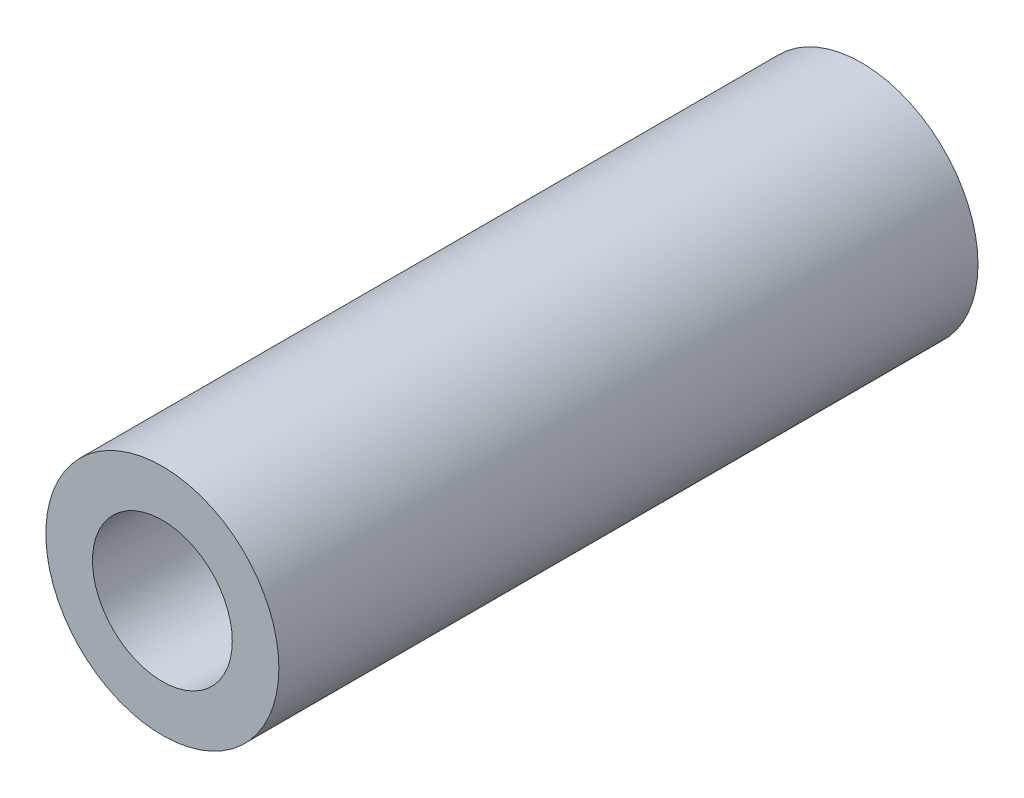
ISO-10303-21;
HEADER;
FILE_DESCRIPTION(('STEP AP214'),'2;1');
FILE_NAME('part.step','',(''),(''),'','','');
FILE_SCHEMA(('AUTOMOTIVE_DESIGN { 1 0 10303 214 1 1 1 1 }'));
ENDSEC;
DATA;
#1=APPLICATION_CONTEXT('core data for automotive mechanical design processes');
#2=APPLICATION_PROTOCOL_DEFINITION('international standard','automotive_design',2000,#1);
#3=PRODUCT_CONTEXT('',#1,'mechanical');
#4=PRODUCT('Part','Part','',(#3));
#5=PRODUCT_RELATED_PRODUCT_CATEGORY('part','',(#4));
#6=PRODUCT_DEFINITION_FORMATION('','',#4);
#7=PRODUCT_DEFINITION_CONTEXT('part definition',#1,'design');
#8=PRODUCT_DEFINITION('design','',#6,#7);
#9=PRODUCT_DEFINITION_SHAPE('','',#8);
#10=(LENGTH_UNIT() NAMED_UNIT(*) SI_UNIT(.MILLI.,.METRE.));
#11=(NAMED_UNIT(*) PLANE_ANGLE_UNIT() SI_UNIT($,.RADIAN.));
#12=(NAMED_UNIT(*) SI_UNIT($,.STERADIAN.) SOLID_ANGLE_UNIT());
#13=UNCERTAINTY_MEASURE_WITH_UNIT(LENGTH_MEASURE(1.E-05),#10,'distance_accuracy_value','');
#14=(GEOMETRIC_REPRESENTATION_CONTEXT(3) GLOBAL_UNCERTAINTY_ASSIGNED_CONTEXT((#13)) GLOBAL_UNIT_ASSIGNED_CONTEXT((#10,
#11,#12)) REPRESENTATION_CONTEXT('',''));
#15=CARTESIAN_POINT('',(0.,0.,0.));
#16=DIRECTION('',(0.,0.,1.));
#17=DIRECTION('',(1.,0.,0.));
#18=AXIS2_PLACEMENT_3D('',#15,#16,#17);
#19=CARTESIAN_POINT('',(0.,0.,25.4));
#20=DIRECTION('',(0.,0.,-1.));
#21=DIRECTION('',(-1.,0.,0.));
#22=AXIS2_PLACEMENT_3D('',#19,#20,#21);
#23=CYLINDRICAL_SURFACE('',#22,7.9375);
#24=CARTESIAN_POINT('',(0.,0.,-25.4));
#25=DIRECTION('',(0.,0.,1.));
#26=DIRECTION('',(1.,0.,0.));
#27=AXIS2_PLACEMENT_3D('',#24,#25,#26);
#28=CIRCLE('',#27,7.9375);
#29=CARTESIAN_POINT('',(7.9375,0.,-25.4));
#30=VERTEX_POINT('',#29);
#31=EDGE_CURVE('E10',#30,#30,#28,.T.);
#32=ORIENTED_EDGE('',*,*,#31,.T.);
#33=EDGE_LOOP('',(#32));
#34=FACE_BOUND('',#33,.T.);
#35=CARTESIAN_POINT('',(0.,0.,22.225));
#36=DIRECTION('',(0.,0.,1.));
#37=DIRECTION('',(1.,0.,0.));
#38=AXIS2_PLACEMENT_3D('',#35,#36,#37);
#39=CIRCLE('',#38,7.9375);
#40=CARTESIAN_POINT('',(7.9375,0.,22.225));
#41=VERTEX_POINT('',#40);
#42=EDGE_CURVE('E37',#41,#41,#39,.T.);
#43=ORIENTED_EDGE('',*,*,#42,.F.);
#44=EDGE_LOOP('',(#43));
#45=FACE_BOUND('',#44,.T.);
#46=ADVANCED_FACE('F31',(#34,#45),#23,.T.);
#47=CARTESIAN_POINT('',(0.,0.,-25.4));
#48=DIRECTION('',(0.,0.,1.));
#49=DIRECTION('',(1.,0.,0.));
#50=AXIS2_PLACEMENT_3D('',#47,#48,#49);
#51=PLANE('',#50);
#52=CARTESIAN_POINT('',(0.,0.,-25.4));
#53=DIRECTION('',(0.,0.,1.));
#54=DIRECTION('',(1.,0.,0.));
#55=AXIS2_PLACEMENT_3D('',#52,#53,#54);
#56=CIRCLE('',#55,4.7625);
#57=CARTESIAN_POINT('',(4.7625,0.,-25.4));
#58=VERTEX_POINT('',#57);
#59=EDGE_CURVE('E41',#58,#58,#56,.T.);
#60=ORIENTED_EDGE('',*,*,#59,.T.);
#61=EDGE_LOOP('',(#60));
#62=FACE_BOUND('',#61,.T.);
#63=ORIENTED_EDGE('',*,*,#31,.F.);
#64=EDGE_LOOP('',(#63));
#65=FACE_BOUND('',#64,.T.);
#66=ADVANCED_FACE('F55',(#62,#65),#51,.F.);
#67=CARTESIAN_POINT('',(0.,0.,22.225));
#68=DIRECTION('',(0.,0.,1.));
#69=DIRECTION('',(1.,0.,0.));
#70=AXIS2_PLACEMENT_3D('',#67,#68,#69);
#71=PLANE('',#70);
#72=CARTESIAN_POINT('',(0.,0.,22.225));
#73=DIRECTION('',(0.,0.,1.));
#74=DIRECTION('',(1.,0.,0.));
#75=AXIS2_PLACEMENT_3D('',#72,#73,#74);
#76=CIRCLE('',#75,4.7625);
#77=CARTESIAN_POINT('',(4.7625,0.,22.225));
#78=VERTEX_POINT('',#77);
#79=EDGE_CURVE('E45',#78,#78,#76,.T.);
#80=ORIENTED_EDGE('',*,*,#79,.F.);
#81=EDGE_LOOP('',(#80));
#82=FACE_BOUND('',#81,.T.);
#83=ORIENTED_EDGE('',*,*,#42,.T.);
#84=EDGE_LOOP('',(#83));
#85=FACE_BOUND('',#84,.T.);
#86=ADVANCED_FACE('F53',(#82,#85),#71,.T.);
#87=CARTESIAN_POINT('',(0.,0.,-25.4));
#88=DIRECTION('',(0.,0.,1.));
#89=DIRECTION('',(1.,0.,0.));
#90=AXIS2_PLACEMENT_3D('',#87,#88,#89);
#91=CYLINDRICAL_SURFACE('',#90,4.7625);
#92=ORIENTED_EDGE('',*,*,#59,.F.);
#93=EDGE_LOOP('',(#92));
#94=FACE_BOUND('',#93,.T.);
#95=ORIENTED_EDGE('',*,*,#79,.T.);
#96=EDGE_LOOP('',(#95));
#97=FACE_BOUND('',#96,.T.);
#98=ADVANCED_FACE('F51',(#94,#97),#91,.F.);
#99=CLOSED_SHELL('',(#46,#66,#86,#98));
#100=MANIFOLD_SOLID_BREP('B2',#99);
#101=ADVANCED_BREP_SHAPE_REPRESENTATION('',(#18,#100),#14);
#102=SHAPE_DEFINITION_REPRESENTATION(#9,#101);
ENDSEC;
END-ISO-10303-21;
